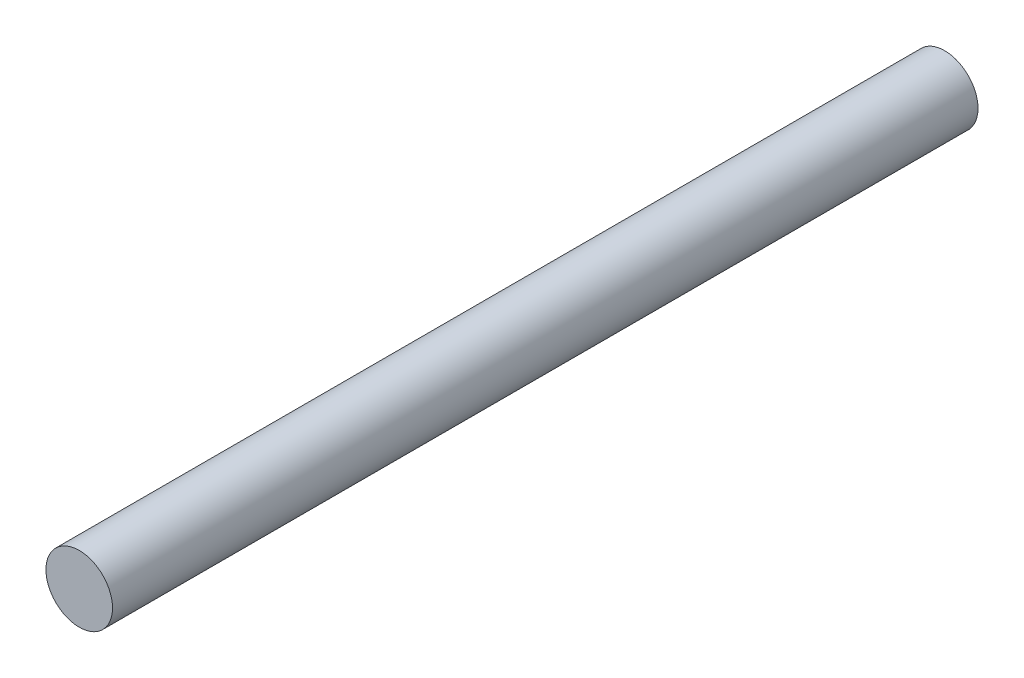
ISO-10303-21;
HEADER;
FILE_DESCRIPTION(('STEP AP214'),'2;1');
FILE_NAME('part.step','',(''),(''),'','','');
FILE_SCHEMA(('AUTOMOTIVE_DESIGN { 1 0 10303 214 1 1 1 1 }'));
ENDSEC;
DATA;
#1=APPLICATION_CONTEXT('core data for automotive mechanical design processes');
#2=APPLICATION_PROTOCOL_DEFINITION('international standard','automotive_design',2000,#1);
#3=PRODUCT_CONTEXT('',#1,'mechanical');
#4=PRODUCT('Part','Part','',(#3));
#5=PRODUCT_RELATED_PRODUCT_CATEGORY('part','',(#4));
#6=PRODUCT_DEFINITION_FORMATION('','',#4);
#7=PRODUCT_DEFINITION_CONTEXT('part definition',#1,'design');
#8=PRODUCT_DEFINITION('design','',#6,#7);
#9=PRODUCT_DEFINITION_SHAPE('','',#8);
#10=(LENGTH_UNIT() NAMED_UNIT(*) SI_UNIT(.MILLI.,.METRE.));
#11=(NAMED_UNIT(*) PLANE_ANGLE_UNIT() SI_UNIT($,.RADIAN.));
#12=(NAMED_UNIT(*) SI_UNIT($,.STERADIAN.) SOLID_ANGLE_UNIT());
#13=UNCERTAINTY_MEASURE_WITH_UNIT(LENGTH_MEASURE(1.E-05),#10,'distance_accuracy_value','');
#14=(GEOMETRIC_REPRESENTATION_CONTEXT(3) GLOBAL_UNCERTAINTY_ASSIGNED_CONTEXT((#13)) GLOBAL_UNIT_ASSIGNED_CONTEXT((#10,
#11,#12)) REPRESENTATION_CONTEXT('',''));
#15=CARTESIAN_POINT('',(0.,0.,0.));
#16=DIRECTION('',(0.,0.,1.));
#17=DIRECTION('',(1.,0.,0.));
#18=AXIS2_PLACEMENT_3D('',#15,#16,#17);
#19=CARTESIAN_POINT('',(0.,0.,130.));
#20=DIRECTION('',(0.,0.,-1.));
#21=DIRECTION('',(-1.,0.,0.));
#22=AXIS2_PLACEMENT_3D('',#19,#20,#21);
#23=CYLINDRICAL_SURFACE('',#22,5.);
#24=CARTESIAN_POINT('',(0.,0.,130.));
#25=DIRECTION('',(0.,0.,1.));
#26=DIRECTION('',(1.,0.,0.));
#27=AXIS2_PLACEMENT_3D('',#24,#25,#26);
#28=CIRCLE('',#27,5.);
#29=CARTESIAN_POINT('',(5.,0.,130.));
#30=VERTEX_POINT('',#29);
#31=EDGE_CURVE('E10',#30,#30,#28,.T.);
#32=ORIENTED_EDGE('',*,*,#31,.F.);
#33=EDGE_LOOP('',(#32));
#34=FACE_BOUND('',#33,.T.);
#35=CARTESIAN_POINT('',(0.,0.,0.));
#36=DIRECTION('',(0.,0.,1.));
#37=DIRECTION('',(1.,0.,0.));
#38=AXIS2_PLACEMENT_3D('',#35,#36,#37);
#39=CIRCLE('',#38,5.);
#40=CARTESIAN_POINT('',(5.,0.,0.));
#41=VERTEX_POINT('',#40);
#42=EDGE_CURVE('E44',#41,#41,#39,.T.);
#43=ORIENTED_EDGE('',*,*,#42,.T.);
#44=EDGE_LOOP('',(#43));
#45=FACE_BOUND('',#44,.T.);
#46=ADVANCED_FACE('F41',(#34,#45),#23,.T.);
#47=CARTESIAN_POINT('',(0.,0.,130.));
#48=DIRECTION('',(0.,0.,1.));
#49=DIRECTION('',(1.,0.,0.));
#50=AXIS2_PLACEMENT_3D('',#47,#48,#49);
#51=PLANE('',#50);
#52=ORIENTED_EDGE('',*,*,#31,.T.);
#53=EDGE_LOOP('',(#52));
#54=FACE_BOUND('',#53,.T.);
#55=ADVANCED_FACE('F56',(#54),#51,.T.);
#56=CARTESIAN_POINT('',(0.,0.,0.));
#57=DIRECTION('',(0.,0.,1.));
#58=DIRECTION('',(1.,0.,0.));
#59=AXIS2_PLACEMENT_3D('',#56,#57,#58);
#60=PLANE('',#59);
#61=ORIENTED_EDGE('',*,*,#42,.F.);
#62=EDGE_LOOP('',(#61));
#63=FACE_BOUND('',#62,.T.);
#64=ADVANCED_FACE('F54',(#63),#60,.F.);
#65=CLOSED_SHELL('',(#46,#55,#64));
#66=MANIFOLD_SOLID_BREP('B2',#65);
#67=ADVANCED_BREP_SHAPE_REPRESENTATION('',(#18,#66),#14);
#68=SHAPE_DEFINITION_REPRESENTATION(#9,#67);
ENDSEC;
END-ISO-10303-21;
